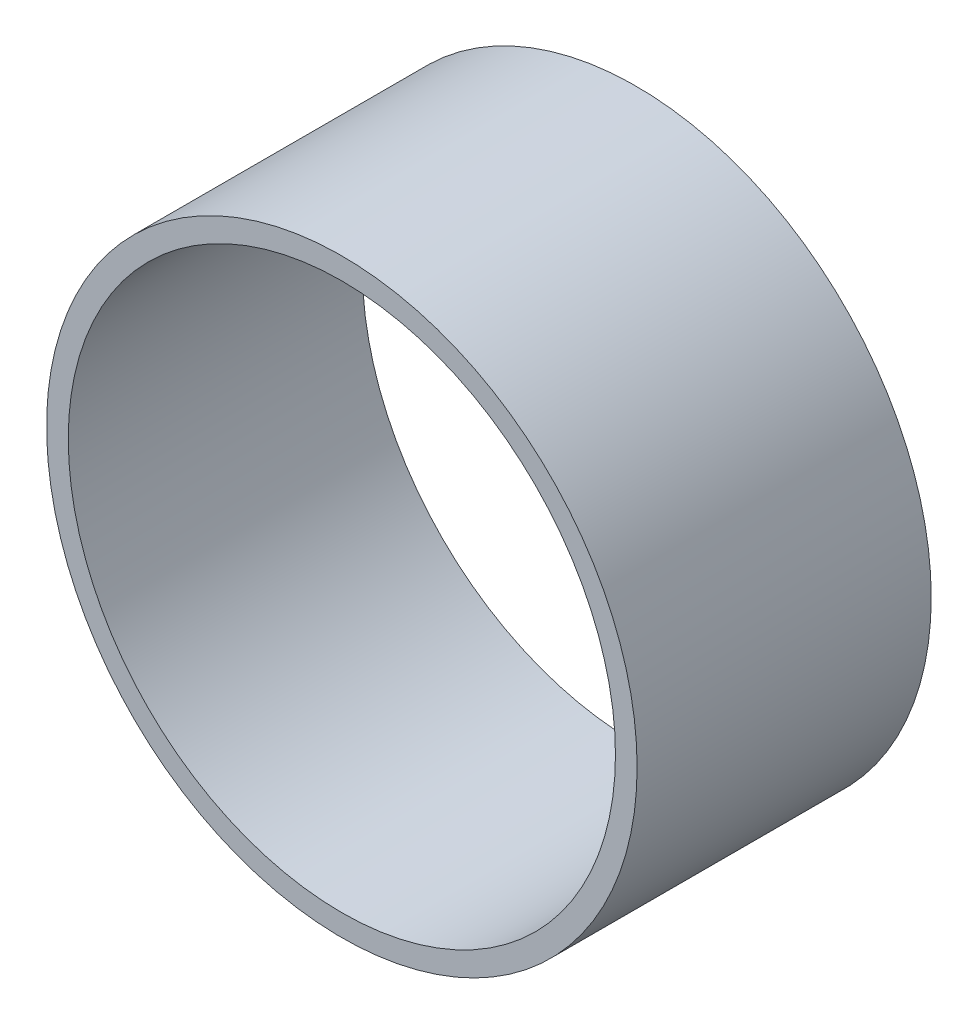
ISO-10303-21;
HEADER;
FILE_DESCRIPTION(('STEP AP214'),'2;1');
FILE_NAME('part.step','',(''),(''),'','','');
FILE_SCHEMA(('AUTOMOTIVE_DESIGN { 1 0 10303 214 1 1 1 1 }'));
ENDSEC;
DATA;
#1=APPLICATION_CONTEXT('core data for automotive mechanical design processes');
#2=APPLICATION_PROTOCOL_DEFINITION('international standard','automotive_design',2000,#1);
#3=PRODUCT_CONTEXT('',#1,'mechanical');
#4=PRODUCT('Part','Part','',(#3));
#5=PRODUCT_RELATED_PRODUCT_CATEGORY('part','',(#4));
#6=PRODUCT_DEFINITION_FORMATION('','',#4);
#7=PRODUCT_DEFINITION_CONTEXT('part definition',#1,'design');
#8=PRODUCT_DEFINITION('design','',#6,#7);
#9=PRODUCT_DEFINITION_SHAPE('','',#8);
#10=(LENGTH_UNIT() NAMED_UNIT(*) SI_UNIT(.MILLI.,.METRE.));
#11=(NAMED_UNIT(*) PLANE_ANGLE_UNIT() SI_UNIT($,.RADIAN.));
#12=(NAMED_UNIT(*) SI_UNIT($,.STERADIAN.) SOLID_ANGLE_UNIT());
#13=UNCERTAINTY_MEASURE_WITH_UNIT(LENGTH_MEASURE(1.E-05),#10,'distance_accuracy_value','');
#14=(GEOMETRIC_REPRESENTATION_CONTEXT(3) GLOBAL_UNCERTAINTY_ASSIGNED_CONTEXT((#13)) GLOBAL_UNIT_ASSIGNED_CONTEXT((#10,
#11,#12)) REPRESENTATION_CONTEXT('',''));
#15=CARTESIAN_POINT('',(0.,0.,0.));
#16=DIRECTION('',(0.,0.,1.));
#17=DIRECTION('',(1.,0.,0.));
#18=AXIS2_PLACEMENT_3D('',#15,#16,#17);
#19=CARTESIAN_POINT('',(0.,0.,38.));
#20=DIRECTION('',(0.,0.,1.));
#21=DIRECTION('',(1.,0.,0.));
#22=AXIS2_PLACEMENT_3D('',#19,#20,#21);
#23=PLANE('',#22);
#24=CARTESIAN_POINT('',(0.,0.,38.));
#25=DIRECTION('',(0.,0.,1.));
#26=DIRECTION('',(1.,0.,0.));
#27=AXIS2_PLACEMENT_3D('',#24,#25,#26);
#28=CIRCLE('',#27,38.15);
#29=CARTESIAN_POINT('',(38.15,0.,38.));
#30=VERTEX_POINT('',#29);
#31=EDGE_CURVE('E10',#30,#30,#28,.T.);
#32=ORIENTED_EDGE('',*,*,#31,.T.);
#33=EDGE_LOOP('',(#32));
#34=FACE_BOUND('',#33,.T.);
#35=CARTESIAN_POINT('',(0.,0.,38.));
#36=DIRECTION('',(0.,0.,1.));
#37=DIRECTION('',(1.,0.,0.));
#38=AXIS2_PLACEMENT_3D('',#35,#36,#37);
#39=CIRCLE('',#38,35.35);
#40=CARTESIAN_POINT('',(35.35,0.,38.));
#41=VERTEX_POINT('',#40);
#42=EDGE_CURVE('E42',#41,#41,#39,.T.);
#43=ORIENTED_EDGE('',*,*,#42,.F.);
#44=EDGE_LOOP('',(#43));
#45=FACE_BOUND('',#44,.T.);
#46=ADVANCED_FACE('F31',(#34,#45),#23,.T.);
#47=CARTESIAN_POINT('',(0.,0.,0.));
#48=DIRECTION('',(0.,0.,1.));
#49=DIRECTION('',(1.,0.,0.));
#50=AXIS2_PLACEMENT_3D('',#47,#48,#49);
#51=PLANE('',#50);
#52=CARTESIAN_POINT('',(0.,0.,0.));
#53=DIRECTION('',(0.,0.,1.));
#54=DIRECTION('',(1.,0.,0.));
#55=AXIS2_PLACEMENT_3D('',#52,#53,#54);
#56=CIRCLE('',#55,38.15);
#57=CARTESIAN_POINT('',(38.15,0.,0.));
#58=VERTEX_POINT('',#57);
#59=EDGE_CURVE('E35',#58,#58,#56,.T.);
#60=ORIENTED_EDGE('',*,*,#59,.F.);
#61=EDGE_LOOP('',(#60));
#62=FACE_BOUND('',#61,.T.);
#63=CARTESIAN_POINT('',(0.,0.,0.));
#64=DIRECTION('',(0.,0.,1.));
#65=DIRECTION('',(1.,0.,0.));
#66=AXIS2_PLACEMENT_3D('',#63,#64,#65);
#67=CIRCLE('',#66,35.35);
#68=CARTESIAN_POINT('',(35.35,0.,0.));
#69=VERTEX_POINT('',#68);
#70=EDGE_CURVE('E44',#69,#69,#67,.T.);
#71=ORIENTED_EDGE('',*,*,#70,.T.);
#72=EDGE_LOOP('',(#71));
#73=FACE_BOUND('',#72,.T.);
#74=ADVANCED_FACE('F54',(#62,#73),#51,.F.);
#75=CARTESIAN_POINT('',(0.,0.,38.));
#76=DIRECTION('',(0.,0.,-1.));
#77=DIRECTION('',(-1.,0.,0.));
#78=AXIS2_PLACEMENT_3D('',#75,#76,#77);
#79=CYLINDRICAL_SURFACE('',#78,38.15);
#80=ORIENTED_EDGE('',*,*,#31,.F.);
#81=EDGE_LOOP('',(#80));
#82=FACE_BOUND('',#81,.T.);
#83=ORIENTED_EDGE('',*,*,#59,.T.);
#84=EDGE_LOOP('',(#83));
#85=FACE_BOUND('',#84,.T.);
#86=ADVANCED_FACE('F33',(#82,#85),#79,.T.);
#87=CARTESIAN_POINT('',(0.,0.,38.));
#88=DIRECTION('',(0.,0.,-1.));
#89=DIRECTION('',(-1.,0.,0.));
#90=AXIS2_PLACEMENT_3D('',#87,#88,#89);
#91=CYLINDRICAL_SURFACE('',#90,35.35);
#92=ORIENTED_EDGE('',*,*,#42,.T.);
#93=EDGE_LOOP('',(#92));
#94=FACE_BOUND('',#93,.T.);
#95=ORIENTED_EDGE('',*,*,#70,.F.);
#96=EDGE_LOOP('',(#95));
#97=FACE_BOUND('',#96,.T.);
#98=ADVANCED_FACE('F50',(#94,#97),#91,.F.);
#99=CLOSED_SHELL('',(#46,#74,#86,#98));
#100=MANIFOLD_SOLID_BREP('B2',#99);
#101=ADVANCED_BREP_SHAPE_REPRESENTATION('',(#18,#100),#14);
#102=SHAPE_DEFINITION_REPRESENTATION(#9,#101);
ENDSEC;
END-ISO-10303-21;
